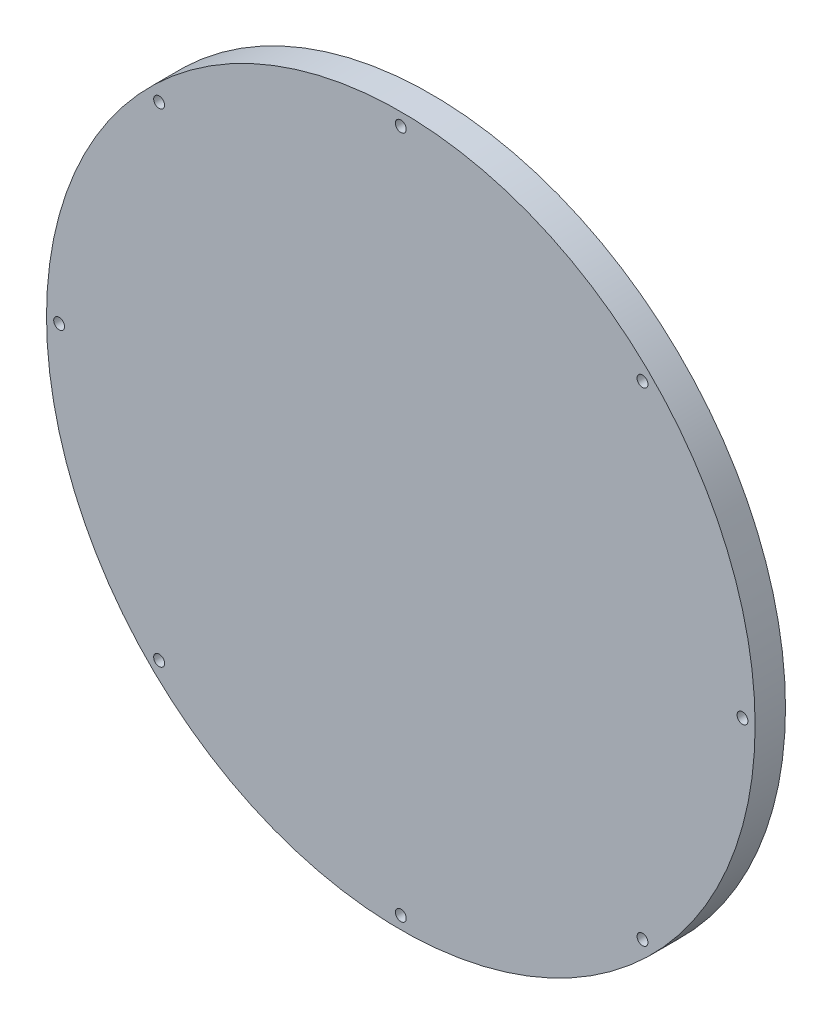
ISO-10303-21;
HEADER;
FILE_DESCRIPTION(('STEP AP214'),'2;1');
FILE_NAME('part.step','',(''),(''),'','','');
FILE_SCHEMA(('AUTOMOTIVE_DESIGN { 1 0 10303 214 1 1 1 1 }'));
ENDSEC;
DATA;
#1=APPLICATION_CONTEXT('core data for automotive mechanical design processes');
#2=APPLICATION_PROTOCOL_DEFINITION('international standard','automotive_design',2000,#1);
#3=PRODUCT_CONTEXT('',#1,'mechanical');
#4=PRODUCT('Part','Part','',(#3));
#5=PRODUCT_RELATED_PRODUCT_CATEGORY('part','',(#4));
#6=PRODUCT_DEFINITION_FORMATION('','',#4);
#7=PRODUCT_DEFINITION_CONTEXT('part definition',#1,'design');
#8=PRODUCT_DEFINITION('design','',#6,#7);
#9=PRODUCT_DEFINITION_SHAPE('','',#8);
#10=(LENGTH_UNIT() NAMED_UNIT(*) SI_UNIT(.MILLI.,.METRE.));
#11=(NAMED_UNIT(*) PLANE_ANGLE_UNIT() SI_UNIT($,.RADIAN.));
#12=(NAMED_UNIT(*) SI_UNIT($,.STERADIAN.) SOLID_ANGLE_UNIT());
#13=UNCERTAINTY_MEASURE_WITH_UNIT(LENGTH_MEASURE(1.E-05),#10,'distance_accuracy_value','');
#14=(GEOMETRIC_REPRESENTATION_CONTEXT(3) GLOBAL_UNCERTAINTY_ASSIGNED_CONTEXT((#13)) GLOBAL_UNIT_ASSIGNED_CONTEXT((#10,
#11,#12)) REPRESENTATION_CONTEXT('',''));
#15=CARTESIAN_POINT('',(0.,0.,0.));
#16=DIRECTION('',(0.,0.,1.));
#17=DIRECTION('',(1.,0.,0.));
#18=AXIS2_PLACEMENT_3D('',#15,#16,#17);
#19=CARTESIAN_POINT('',(0.,0.,12.));
#20=DIRECTION('',(0.,0.,-1.));
#21=DIRECTION('',(-1.,0.,0.));
#22=AXIS2_PLACEMENT_3D('',#19,#20,#21);
#23=CYLINDRICAL_SURFACE('',#22,140.);
#24=CARTESIAN_POINT('',(0.,0.,12.));
#25=DIRECTION('',(0.,0.,1.));
#26=DIRECTION('',(1.,0.,0.));
#27=AXIS2_PLACEMENT_3D('',#24,#25,#26);
#28=CIRCLE('',#27,140.);
#29=CARTESIAN_POINT('',(140.,0.,12.));
#30=VERTEX_POINT('',#29);
#31=EDGE_CURVE('E10',#30,#30,#28,.T.);
#32=ORIENTED_EDGE('',*,*,#31,.F.);
#33=EDGE_LOOP('',(#32));
#34=FACE_BOUND('',#33,.T.);
#35=CARTESIAN_POINT('',(0.,0.,0.));
#36=DIRECTION('',(0.,0.,1.));
#37=DIRECTION('',(1.,0.,0.));
#38=AXIS2_PLACEMENT_3D('',#35,#36,#37);
#39=CIRCLE('',#38,140.);
#40=CARTESIAN_POINT('',(140.,0.,0.));
#41=VERTEX_POINT('',#40);
#42=EDGE_CURVE('E36',#41,#41,#39,.T.);
#43=ORIENTED_EDGE('',*,*,#42,.T.);
#44=EDGE_LOOP('',(#43));
#45=FACE_BOUND('',#44,.T.);
#46=ADVANCED_FACE('F33',(#34,#45),#23,.T.);
#47=CARTESIAN_POINT('',(0.,0.,12.));
#48=DIRECTION('',(0.,0.,1.));
#49=DIRECTION('',(1.,0.,0.));
#50=AXIS2_PLACEMENT_3D('',#47,#48,#49);
#51=PLANE('',#50);
#52=CARTESIAN_POINT('',(0.,135.,12.));
#53=DIRECTION('',(0.,0.,-1.));
#54=DIRECTION('',(-1.,0.,0.));
#55=AXIS2_PLACEMENT_3D('',#52,#53,#54);
#56=CIRCLE('',#55,2.15);
#57=CARTESIAN_POINT('',(-2.15,135.,12.));
#58=VERTEX_POINT('',#57);
#59=EDGE_CURVE('E107',#58,#58,#56,.T.);
#60=ORIENTED_EDGE('',*,*,#59,.T.);
#61=EDGE_LOOP('',(#60));
#62=FACE_BOUND('',#61,.T.);
#63=CARTESIAN_POINT('',(-135.,0.,12.));
#64=DIRECTION('',(0.,0.,-1.));
#65=DIRECTION('',(-1.,0.,0.));
#66=AXIS2_PLACEMENT_3D('',#63,#64,#65);
#67=CIRCLE('',#66,2.14999999999999);
#68=CARTESIAN_POINT('',(-137.15,0.,12.));
#69=VERTEX_POINT('',#68);
#70=EDGE_CURVE('E98',#69,#69,#67,.T.);
#71=ORIENTED_EDGE('',*,*,#70,.T.);
#72=EDGE_LOOP('',(#71));
#73=FACE_BOUND('',#72,.T.);
#74=CARTESIAN_POINT('',(0.,-135.,12.));
#75=DIRECTION('',(0.,0.,-1.));
#76=DIRECTION('',(-1.,0.,0.));
#77=AXIS2_PLACEMENT_3D('',#74,#75,#76);
#78=CIRCLE('',#77,2.15);
#79=CARTESIAN_POINT('',(-2.15,-135.,12.));
#80=VERTEX_POINT('',#79);
#81=EDGE_CURVE('E89',#80,#80,#78,.T.);
#82=ORIENTED_EDGE('',*,*,#81,.T.);
#83=EDGE_LOOP('',(#82));
#84=FACE_BOUND('',#83,.T.);
#85=CARTESIAN_POINT('',(135.,0.,12.));
#86=DIRECTION('',(0.,0.,-1.));
#87=DIRECTION('',(-1.,0.,0.));
#88=AXIS2_PLACEMENT_3D('',#85,#86,#87);
#89=CIRCLE('',#88,2.14999999999999);
#90=CARTESIAN_POINT('',(132.85,0.,12.));
#91=VERTEX_POINT('',#90);
#92=EDGE_CURVE('E80',#91,#91,#89,.T.);
#93=ORIENTED_EDGE('',*,*,#92,.T.);
#94=EDGE_LOOP('',(#93));
#95=FACE_BOUND('',#94,.T.);
#96=CARTESIAN_POINT('',(95.5,95.5,12.));
#97=DIRECTION('',(0.,0.,-1.));
#98=DIRECTION('',(-1.,0.,0.));
#99=AXIS2_PLACEMENT_3D('',#96,#97,#98);
#100=CIRCLE('',#99,2.15);
#101=CARTESIAN_POINT('',(93.35,95.5,12.));
#102=VERTEX_POINT('',#101);
#103=EDGE_CURVE('E71',#102,#102,#100,.T.);
#104=ORIENTED_EDGE('',*,*,#103,.T.);
#105=EDGE_LOOP('',(#104));
#106=FACE_BOUND('',#105,.T.);
#107=CARTESIAN_POINT('',(-95.5,95.5,12.));
#108=DIRECTION('',(0.,0.,-1.));
#109=DIRECTION('',(-1.,0.,0.));
#110=AXIS2_PLACEMENT_3D('',#107,#108,#109);
#111=CIRCLE('',#110,2.15);
#112=CARTESIAN_POINT('',(-97.65,95.5,12.));
#113=VERTEX_POINT('',#112);
#114=EDGE_CURVE('E62',#113,#113,#111,.T.);
#115=ORIENTED_EDGE('',*,*,#114,.T.);
#116=EDGE_LOOP('',(#115));
#117=FACE_BOUND('',#116,.T.);
#118=CARTESIAN_POINT('',(-95.5,-95.5,12.));
#119=DIRECTION('',(0.,0.,-1.));
#120=DIRECTION('',(-1.,0.,0.));
#121=AXIS2_PLACEMENT_3D('',#118,#119,#120);
#122=CIRCLE('',#121,2.15);
#123=CARTESIAN_POINT('',(-97.65,-95.5,12.));
#124=VERTEX_POINT('',#123);
#125=EDGE_CURVE('E53',#124,#124,#122,.T.);
#126=ORIENTED_EDGE('',*,*,#125,.T.);
#127=EDGE_LOOP('',(#126));
#128=FACE_BOUND('',#127,.T.);
#129=CARTESIAN_POINT('',(95.5,-95.5,12.));
#130=DIRECTION('',(0.,0.,-1.));
#131=DIRECTION('',(-1.,0.,0.));
#132=AXIS2_PLACEMENT_3D('',#129,#130,#131);
#133=CIRCLE('',#132,2.15);
#134=CARTESIAN_POINT('',(93.35,-95.5,12.));
#135=VERTEX_POINT('',#134);
#136=EDGE_CURVE('E43',#135,#135,#133,.T.);
#137=ORIENTED_EDGE('',*,*,#136,.T.);
#138=EDGE_LOOP('',(#137));
#139=FACE_BOUND('',#138,.T.);
#140=ORIENTED_EDGE('',*,*,#31,.T.);
#141=EDGE_LOOP('',(#140));
#142=FACE_BOUND('',#141,.T.);
#143=ADVANCED_FACE('F123',(#62,#73,#84,#95,#106,#117,#128,#139,#142),#51,.T.);
#144=CARTESIAN_POINT('',(0.,0.,0.));
#145=DIRECTION('',(0.,0.,1.));
#146=DIRECTION('',(1.,0.,0.));
#147=AXIS2_PLACEMENT_3D('',#144,#145,#146);
#148=PLANE('',#147);
#149=CARTESIAN_POINT('',(0.,135.,0.));
#150=DIRECTION('',(0.,0.,-1.));
#151=DIRECTION('',(-1.,0.,0.));
#152=AXIS2_PLACEMENT_3D('',#149,#150,#151);
#153=CIRCLE('',#152,4.7);
#154=CARTESIAN_POINT('',(-4.7,135.,0.));
#155=VERTEX_POINT('',#154);
#156=EDGE_CURVE('E113',#155,#155,#153,.T.);
#157=ORIENTED_EDGE('',*,*,#156,.F.);
#158=EDGE_LOOP('',(#157));
#159=FACE_BOUND('',#158,.T.);
#160=CARTESIAN_POINT('',(-135.,0.,0.));
#161=DIRECTION('',(0.,0.,-1.));
#162=DIRECTION('',(-1.,0.,0.));
#163=AXIS2_PLACEMENT_3D('',#160,#161,#162);
#164=CIRCLE('',#163,4.70000000000001);
#165=CARTESIAN_POINT('',(-139.7,0.,0.));
#166=VERTEX_POINT('',#165);
#167=EDGE_CURVE('E104',#166,#166,#164,.T.);
#168=ORIENTED_EDGE('',*,*,#167,.F.);
#169=EDGE_LOOP('',(#168));
#170=FACE_BOUND('',#169,.T.);
#171=CARTESIAN_POINT('',(0.,-135.,0.));
#172=DIRECTION('',(0.,0.,-1.));
#173=DIRECTION('',(-1.,0.,0.));
#174=AXIS2_PLACEMENT_3D('',#171,#172,#173);
#175=CIRCLE('',#174,4.7);
#176=CARTESIAN_POINT('',(-4.7,-135.,0.));
#177=VERTEX_POINT('',#176);
#178=EDGE_CURVE('E95',#177,#177,#175,.T.);
#179=ORIENTED_EDGE('',*,*,#178,.F.);
#180=EDGE_LOOP('',(#179));
#181=FACE_BOUND('',#180,.T.);
#182=CARTESIAN_POINT('',(135.,0.,0.));
#183=DIRECTION('',(0.,0.,-1.));
#184=DIRECTION('',(-1.,0.,0.));
#185=AXIS2_PLACEMENT_3D('',#182,#183,#184);
#186=CIRCLE('',#185,4.70000000000001);
#187=CARTESIAN_POINT('',(130.3,0.,0.));
#188=VERTEX_POINT('',#187);
#189=EDGE_CURVE('E86',#188,#188,#186,.T.);
#190=ORIENTED_EDGE('',*,*,#189,.F.);
#191=EDGE_LOOP('',(#190));
#192=FACE_BOUND('',#191,.T.);
#193=CARTESIAN_POINT('',(95.5,95.5,0.));
#194=DIRECTION('',(0.,0.,-1.));
#195=DIRECTION('',(-1.,0.,0.));
#196=AXIS2_PLACEMENT_3D('',#193,#194,#195);
#197=CIRCLE('',#196,4.7);
#198=CARTESIAN_POINT('',(90.8,95.5,0.));
#199=VERTEX_POINT('',#198);
#200=EDGE_CURVE('E77',#199,#199,#197,.T.);
#201=ORIENTED_EDGE('',*,*,#200,.F.);
#202=EDGE_LOOP('',(#201));
#203=FACE_BOUND('',#202,.T.);
#204=CARTESIAN_POINT('',(-95.5,95.5,0.));
#205=DIRECTION('',(0.,0.,-1.));
#206=DIRECTION('',(-1.,0.,0.));
#207=AXIS2_PLACEMENT_3D('',#204,#205,#206);
#208=CIRCLE('',#207,4.7);
#209=CARTESIAN_POINT('',(-100.2,95.5,0.));
#210=VERTEX_POINT('',#209);
#211=EDGE_CURVE('E68',#210,#210,#208,.T.);
#212=ORIENTED_EDGE('',*,*,#211,.F.);
#213=EDGE_LOOP('',(#212));
#214=FACE_BOUND('',#213,.T.);
#215=CARTESIAN_POINT('',(-95.5,-95.5,0.));
#216=DIRECTION('',(0.,0.,-1.));
#217=DIRECTION('',(-1.,0.,0.));
#218=AXIS2_PLACEMENT_3D('',#215,#216,#217);
#219=CIRCLE('',#218,4.7);
#220=CARTESIAN_POINT('',(-100.2,-95.5,0.));
#221=VERTEX_POINT('',#220);
#222=EDGE_CURVE('E59',#221,#221,#219,.T.);
#223=ORIENTED_EDGE('',*,*,#222,.F.);
#224=EDGE_LOOP('',(#223));
#225=FACE_BOUND('',#224,.T.);
#226=CARTESIAN_POINT('',(95.5,-95.5,0.));
#227=DIRECTION('',(0.,0.,-1.));
#228=DIRECTION('',(-1.,0.,0.));
#229=AXIS2_PLACEMENT_3D('',#226,#227,#228);
#230=CIRCLE('',#229,4.7);
#231=CARTESIAN_POINT('',(90.8,-95.5,0.));
#232=VERTEX_POINT('',#231);
#233=EDGE_CURVE('E50',#232,#232,#230,.T.);
#234=ORIENTED_EDGE('',*,*,#233,.F.);
#235=EDGE_LOOP('',(#234));
#236=FACE_BOUND('',#235,.T.);
#237=ORIENTED_EDGE('',*,*,#42,.F.);
#238=EDGE_LOOP('',(#237));
#239=FACE_BOUND('',#238,.T.);
#240=ADVANCED_FACE('F119',(#159,#170,#181,#192,#203,#214,#225,#236,#239),#148,.F.);
#241=CARTESIAN_POINT('',(95.5,-95.5,0.));
#242=DIRECTION('',(0.,0.,-1.));
#243=DIRECTION('',(-1.,0.,0.));
#244=AXIS2_PLACEMENT_3D('',#241,#242,#243);
#245=CYLINDRICAL_SURFACE('',#244,2.15);
#246=ORIENTED_EDGE('',*,*,#136,.F.);
#247=EDGE_LOOP('',(#246));
#248=FACE_BOUND('',#247,.T.);
#249=CARTESIAN_POINT('',(95.5,-95.5,2.55));
#250=DIRECTION('',(0.,0.,-1.));
#251=DIRECTION('',(-1.,0.,0.));
#252=AXIS2_PLACEMENT_3D('',#249,#250,#251);
#253=CIRCLE('',#252,2.15);
#254=CARTESIAN_POINT('',(93.35,-95.5,2.55));
#255=VERTEX_POINT('',#254);
#256=EDGE_CURVE('E47',#255,#255,#253,.T.);
#257=ORIENTED_EDGE('',*,*,#256,.T.);
#258=EDGE_LOOP('',(#257));
#259=FACE_BOUND('',#258,.T.);
#260=ADVANCED_FACE('F122',(#248,#259),#245,.F.);
#261=CARTESIAN_POINT('',(95.5,-95.5,0.));
#262=DIRECTION('',(0.,0.,-1.));
#263=DIRECTION('',(-1.,0.,0.));
#264=AXIS2_PLACEMENT_3D('',#261,#262,#263);
#265=CONICAL_SURFACE('',#264,4.7,0.785398163397447);
#266=ORIENTED_EDGE('',*,*,#256,.F.);
#267=EDGE_LOOP('',(#266));
#268=FACE_BOUND('',#267,.T.);
#269=ORIENTED_EDGE('',*,*,#233,.T.);
#270=EDGE_LOOP('',(#269));
#271=FACE_BOUND('',#270,.T.);
#272=ADVANCED_FACE('F153',(#268,#271),#265,.F.);
#273=CARTESIAN_POINT('',(-95.5,-95.5,0.));
#274=DIRECTION('',(0.,0.,-1.));
#275=DIRECTION('',(-1.,0.,0.));
#276=AXIS2_PLACEMENT_3D('',#273,#274,#275);
#277=CYLINDRICAL_SURFACE('',#276,2.15);
#278=ORIENTED_EDGE('',*,*,#125,.F.);
#279=EDGE_LOOP('',(#278));
#280=FACE_BOUND('',#279,.T.);
#281=CARTESIAN_POINT('',(-95.5,-95.5,2.55));
#282=DIRECTION('',(0.,0.,-1.));
#283=DIRECTION('',(-1.,0.,0.));
#284=AXIS2_PLACEMENT_3D('',#281,#282,#283);
#285=CIRCLE('',#284,2.15);
#286=CARTESIAN_POINT('',(-97.65,-95.5,2.55));
#287=VERTEX_POINT('',#286);
#288=EDGE_CURVE('E56',#287,#287,#285,.T.);
#289=ORIENTED_EDGE('',*,*,#288,.T.);
#290=EDGE_LOOP('',(#289));
#291=FACE_BOUND('',#290,.T.);
#292=ADVANCED_FACE('F157',(#280,#291),#277,.F.);
#293=CARTESIAN_POINT('',(-95.5,-95.5,0.));
#294=DIRECTION('',(0.,0.,-1.));
#295=DIRECTION('',(-1.,0.,0.));
#296=AXIS2_PLACEMENT_3D('',#293,#294,#295);
#297=CONICAL_SURFACE('',#296,4.7,0.785398163397447);
#298=ORIENTED_EDGE('',*,*,#288,.F.);
#299=EDGE_LOOP('',(#298));
#300=FACE_BOUND('',#299,.T.);
#301=ORIENTED_EDGE('',*,*,#222,.T.);
#302=EDGE_LOOP('',(#301));
#303=FACE_BOUND('',#302,.T.);
#304=ADVANCED_FACE('F161',(#300,#303),#297,.F.);
#305=CARTESIAN_POINT('',(-95.5,95.5,0.));
#306=DIRECTION('',(0.,0.,-1.));
#307=DIRECTION('',(-1.,0.,0.));
#308=AXIS2_PLACEMENT_3D('',#305,#306,#307);
#309=CYLINDRICAL_SURFACE('',#308,2.15);
#310=ORIENTED_EDGE('',*,*,#114,.F.);
#311=EDGE_LOOP('',(#310));
#312=FACE_BOUND('',#311,.T.);
#313=CARTESIAN_POINT('',(-95.5,95.5,2.55));
#314=DIRECTION('',(0.,0.,-1.));
#315=DIRECTION('',(-1.,0.,0.));
#316=AXIS2_PLACEMENT_3D('',#313,#314,#315);
#317=CIRCLE('',#316,2.15);
#318=CARTESIAN_POINT('',(-97.65,95.5,2.55));
#319=VERTEX_POINT('',#318);
#320=EDGE_CURVE('E65',#319,#319,#317,.T.);
#321=ORIENTED_EDGE('',*,*,#320,.T.);
#322=EDGE_LOOP('',(#321));
#323=FACE_BOUND('',#322,.T.);
#324=ADVANCED_FACE('F165',(#312,#323),#309,.F.);
#325=CARTESIAN_POINT('',(-95.5,95.5,0.));
#326=DIRECTION('',(0.,0.,-1.));
#327=DIRECTION('',(-1.,0.,0.));
#328=AXIS2_PLACEMENT_3D('',#325,#326,#327);
#329=CONICAL_SURFACE('',#328,4.7,0.785398163397447);
#330=ORIENTED_EDGE('',*,*,#320,.F.);
#331=EDGE_LOOP('',(#330));
#332=FACE_BOUND('',#331,.T.);
#333=ORIENTED_EDGE('',*,*,#211,.T.);
#334=EDGE_LOOP('',(#333));
#335=FACE_BOUND('',#334,.T.);
#336=ADVANCED_FACE('F169',(#332,#335),#329,.F.);
#337=CARTESIAN_POINT('',(95.5,95.5,0.));
#338=DIRECTION('',(0.,0.,-1.));
#339=DIRECTION('',(-1.,0.,0.));
#340=AXIS2_PLACEMENT_3D('',#337,#338,#339);
#341=CYLINDRICAL_SURFACE('',#340,2.15);
#342=ORIENTED_EDGE('',*,*,#103,.F.);
#343=EDGE_LOOP('',(#342));
#344=FACE_BOUND('',#343,.T.);
#345=CARTESIAN_POINT('',(95.5,95.5,2.55));
#346=DIRECTION('',(0.,0.,-1.));
#347=DIRECTION('',(-1.,0.,0.));
#348=AXIS2_PLACEMENT_3D('',#345,#346,#347);
#349=CIRCLE('',#348,2.15);
#350=CARTESIAN_POINT('',(93.35,95.5,2.55));
#351=VERTEX_POINT('',#350);
#352=EDGE_CURVE('E74',#351,#351,#349,.T.);
#353=ORIENTED_EDGE('',*,*,#352,.T.);
#354=EDGE_LOOP('',(#353));
#355=FACE_BOUND('',#354,.T.);
#356=ADVANCED_FACE('F173',(#344,#355),#341,.F.);
#357=CARTESIAN_POINT('',(95.5,95.5,0.));
#358=DIRECTION('',(0.,0.,-1.));
#359=DIRECTION('',(-1.,0.,0.));
#360=AXIS2_PLACEMENT_3D('',#357,#358,#359);
#361=CONICAL_SURFACE('',#360,4.7,0.785398163397447);
#362=ORIENTED_EDGE('',*,*,#352,.F.);
#363=EDGE_LOOP('',(#362));
#364=FACE_BOUND('',#363,.T.);
#365=ORIENTED_EDGE('',*,*,#200,.T.);
#366=EDGE_LOOP('',(#365));
#367=FACE_BOUND('',#366,.T.);
#368=ADVANCED_FACE('F177',(#364,#367),#361,.F.);
#369=CARTESIAN_POINT('',(135.,0.,0.));
#370=DIRECTION('',(0.,0.,-1.));
#371=DIRECTION('',(-1.,0.,0.));
#372=AXIS2_PLACEMENT_3D('',#369,#370,#371);
#373=CYLINDRICAL_SURFACE('',#372,2.14999999999999);
#374=ORIENTED_EDGE('',*,*,#92,.F.);
#375=EDGE_LOOP('',(#374));
#376=FACE_BOUND('',#375,.T.);
#377=CARTESIAN_POINT('',(135.,0.,2.55));
#378=DIRECTION('',(0.,0.,-1.));
#379=DIRECTION('',(-1.,0.,0.));
#380=AXIS2_PLACEMENT_3D('',#377,#378,#379);
#381=CIRCLE('',#380,2.14999999999999);
#382=CARTESIAN_POINT('',(132.85,0.,2.55));
#383=VERTEX_POINT('',#382);
#384=EDGE_CURVE('E83',#383,#383,#381,.T.);
#385=ORIENTED_EDGE('',*,*,#384,.T.);
#386=EDGE_LOOP('',(#385));
#387=FACE_BOUND('',#386,.T.);
#388=ADVANCED_FACE('F181',(#376,#387),#373,.F.);
#389=CARTESIAN_POINT('',(135.,0.,0.));
#390=DIRECTION('',(0.,0.,-1.));
#391=DIRECTION('',(-1.,0.,0.));
#392=AXIS2_PLACEMENT_3D('',#389,#390,#391);
#393=CONICAL_SURFACE('',#392,4.70000000000001,0.785398163397453);
#394=ORIENTED_EDGE('',*,*,#384,.F.);
#395=EDGE_LOOP('',(#394));
#396=FACE_BOUND('',#395,.T.);
#397=ORIENTED_EDGE('',*,*,#189,.T.);
#398=EDGE_LOOP('',(#397));
#399=FACE_BOUND('',#398,.T.);
#400=ADVANCED_FACE('F185',(#396,#399),#393,.F.);
#401=CARTESIAN_POINT('',(0.,-135.,0.));
#402=DIRECTION('',(0.,0.,-1.));
#403=DIRECTION('',(-1.,0.,0.));
#404=AXIS2_PLACEMENT_3D('',#401,#402,#403);
#405=CYLINDRICAL_SURFACE('',#404,2.15);
#406=ORIENTED_EDGE('',*,*,#81,.F.);
#407=EDGE_LOOP('',(#406));
#408=FACE_BOUND('',#407,.T.);
#409=CARTESIAN_POINT('',(0.,-135.,2.55));
#410=DIRECTION('',(0.,0.,-1.));
#411=DIRECTION('',(-1.,0.,0.));
#412=AXIS2_PLACEMENT_3D('',#409,#410,#411);
#413=CIRCLE('',#412,2.15);
#414=CARTESIAN_POINT('',(-2.15,-135.,2.55));
#415=VERTEX_POINT('',#414);
#416=EDGE_CURVE('E92',#415,#415,#413,.T.);
#417=ORIENTED_EDGE('',*,*,#416,.T.);
#418=EDGE_LOOP('',(#417));
#419=FACE_BOUND('',#418,.T.);
#420=ADVANCED_FACE('F189',(#408,#419),#405,.F.);
#421=CARTESIAN_POINT('',(0.,-135.,0.));
#422=DIRECTION('',(0.,0.,-1.));
#423=DIRECTION('',(-1.,0.,0.));
#424=AXIS2_PLACEMENT_3D('',#421,#422,#423);
#425=CONICAL_SURFACE('',#424,4.7,0.785398163397448);
#426=ORIENTED_EDGE('',*,*,#416,.F.);
#427=EDGE_LOOP('',(#426));
#428=FACE_BOUND('',#427,.T.);
#429=ORIENTED_EDGE('',*,*,#178,.T.);
#430=EDGE_LOOP('',(#429));
#431=FACE_BOUND('',#430,.T.);
#432=ADVANCED_FACE('F193',(#428,#431),#425,.F.);
#433=CARTESIAN_POINT('',(-135.,0.,0.));
#434=DIRECTION('',(0.,0.,-1.));
#435=DIRECTION('',(-1.,0.,0.));
#436=AXIS2_PLACEMENT_3D('',#433,#434,#435);
#437=CYLINDRICAL_SURFACE('',#436,2.14999999999999);
#438=ORIENTED_EDGE('',*,*,#70,.F.);
#439=EDGE_LOOP('',(#438));
#440=FACE_BOUND('',#439,.T.);
#441=CARTESIAN_POINT('',(-135.,0.,2.55));
#442=DIRECTION('',(0.,0.,-1.));
#443=DIRECTION('',(-1.,0.,0.));
#444=AXIS2_PLACEMENT_3D('',#441,#442,#443);
#445=CIRCLE('',#444,2.14999999999999);
#446=CARTESIAN_POINT('',(-137.15,0.,2.55));
#447=VERTEX_POINT('',#446);
#448=EDGE_CURVE('E101',#447,#447,#445,.T.);
#449=ORIENTED_EDGE('',*,*,#448,.T.);
#450=EDGE_LOOP('',(#449));
#451=FACE_BOUND('',#450,.T.);
#452=ADVANCED_FACE('F197',(#440,#451),#437,.F.);
#453=CARTESIAN_POINT('',(-135.,0.,0.));
#454=DIRECTION('',(0.,0.,-1.));
#455=DIRECTION('',(-1.,0.,0.));
#456=AXIS2_PLACEMENT_3D('',#453,#454,#455);
#457=CONICAL_SURFACE('',#456,4.70000000000001,0.785398163397453);
#458=ORIENTED_EDGE('',*,*,#448,.F.);
#459=EDGE_LOOP('',(#458));
#460=FACE_BOUND('',#459,.T.);
#461=ORIENTED_EDGE('',*,*,#167,.T.);
#462=EDGE_LOOP('',(#461));
#463=FACE_BOUND('',#462,.T.);
#464=ADVANCED_FACE('F201',(#460,#463),#457,.F.);
#465=CARTESIAN_POINT('',(0.,135.,0.));
#466=DIRECTION('',(0.,0.,-1.));
#467=DIRECTION('',(-1.,0.,0.));
#468=AXIS2_PLACEMENT_3D('',#465,#466,#467);
#469=CYLINDRICAL_SURFACE('',#468,2.15);
#470=ORIENTED_EDGE('',*,*,#59,.F.);
#471=EDGE_LOOP('',(#470));
#472=FACE_BOUND('',#471,.T.);
#473=CARTESIAN_POINT('',(0.,135.,2.55));
#474=DIRECTION('',(0.,0.,-1.));
#475=DIRECTION('',(-1.,0.,0.));
#476=AXIS2_PLACEMENT_3D('',#473,#474,#475);
#477=CIRCLE('',#476,2.15);
#478=CARTESIAN_POINT('',(-2.15,135.,2.55));
#479=VERTEX_POINT('',#478);
#480=EDGE_CURVE('E110',#479,#479,#477,.T.);
#481=ORIENTED_EDGE('',*,*,#480,.T.);
#482=EDGE_LOOP('',(#481));
#483=FACE_BOUND('',#482,.T.);
#484=ADVANCED_FACE('F205',(#472,#483),#469,.F.);
#485=CARTESIAN_POINT('',(0.,135.,0.));
#486=DIRECTION('',(0.,0.,-1.));
#487=DIRECTION('',(-1.,0.,0.));
#488=AXIS2_PLACEMENT_3D('',#485,#486,#487);
#489=CONICAL_SURFACE('',#488,4.7,0.785398163397448);
#490=ORIENTED_EDGE('',*,*,#480,.F.);
#491=EDGE_LOOP('',(#490));
#492=FACE_BOUND('',#491,.T.);
#493=ORIENTED_EDGE('',*,*,#156,.T.);
#494=EDGE_LOOP('',(#493));
#495=FACE_BOUND('',#494,.T.);
#496=ADVANCED_FACE('F117',(#492,#495),#489,.F.);
#497=CLOSED_SHELL('',(#46,#143,#240,#260,#272,#292,#304,#324,#336,#356,#368,#388,#400,#420,#432,
#452,#464,#484,#496));
#498=MANIFOLD_SOLID_BREP('B2',#497);
#499=ADVANCED_BREP_SHAPE_REPRESENTATION('',(#18,#498),#14);
#500=SHAPE_DEFINITION_REPRESENTATION(#9,#499);
ENDSEC;
END-ISO-10303-21;
